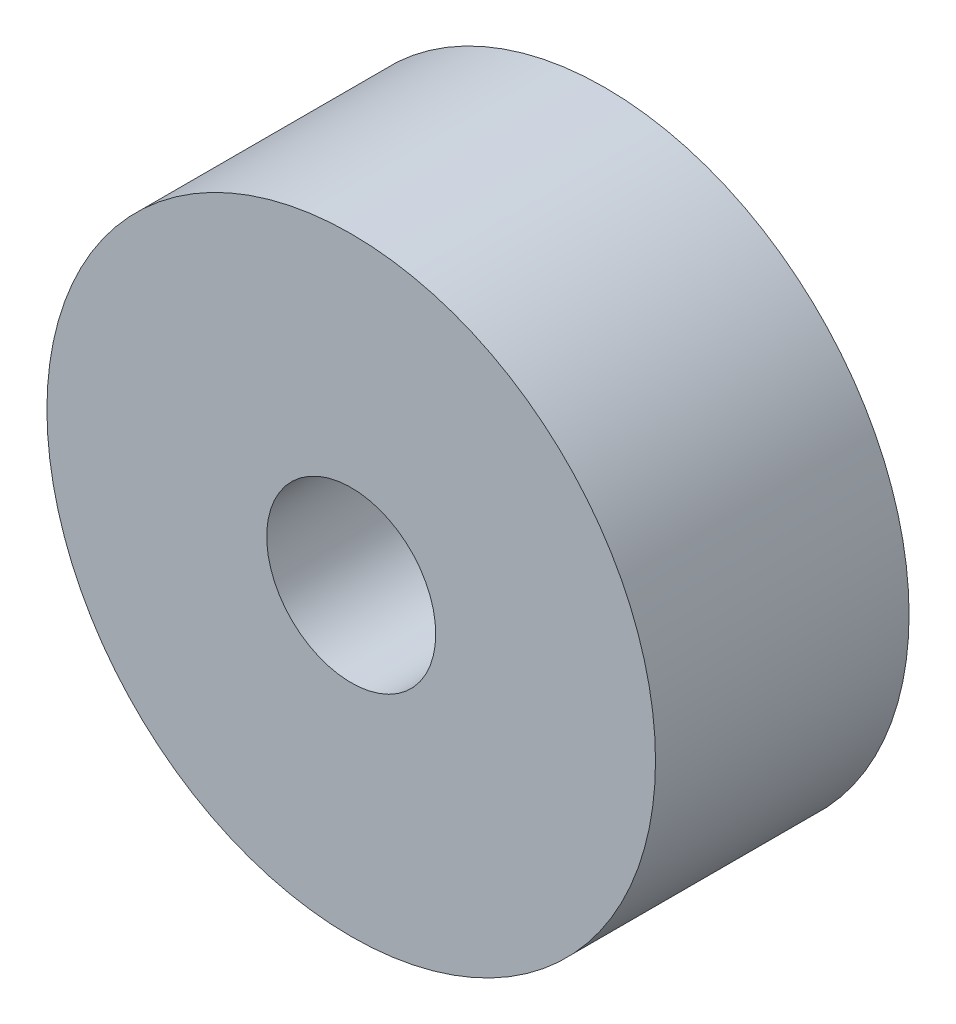
ISO-10303-21;
HEADER;
FILE_DESCRIPTION(('STEP AP214'),'2;1');
FILE_NAME('part.step','',(''),(''),'','','');
FILE_SCHEMA(('AUTOMOTIVE_DESIGN { 1 0 10303 214 1 1 1 1 }'));
ENDSEC;
DATA;
#1=APPLICATION_CONTEXT('core data for automotive mechanical design processes');
#2=APPLICATION_PROTOCOL_DEFINITION('international standard','automotive_design',2000,#1);
#3=PRODUCT_CONTEXT('',#1,'mechanical');
#4=PRODUCT('Part','Part','',(#3));
#5=PRODUCT_RELATED_PRODUCT_CATEGORY('part','',(#4));
#6=PRODUCT_DEFINITION_FORMATION('','',#4);
#7=PRODUCT_DEFINITION_CONTEXT('part definition',#1,'design');
#8=PRODUCT_DEFINITION('design','',#6,#7);
#9=PRODUCT_DEFINITION_SHAPE('','',#8);
#10=(LENGTH_UNIT() NAMED_UNIT(*) SI_UNIT(.MILLI.,.METRE.));
#11=(NAMED_UNIT(*) PLANE_ANGLE_UNIT() SI_UNIT($,.RADIAN.));
#12=(NAMED_UNIT(*) SI_UNIT($,.STERADIAN.) SOLID_ANGLE_UNIT());
#13=UNCERTAINTY_MEASURE_WITH_UNIT(LENGTH_MEASURE(1.E-05),#10,'distance_accuracy_value','');
#14=(GEOMETRIC_REPRESENTATION_CONTEXT(3) GLOBAL_UNCERTAINTY_ASSIGNED_CONTEXT((#13)) GLOBAL_UNIT_ASSIGNED_CONTEXT((#10,
#11,#12)) REPRESENTATION_CONTEXT('',''));
#15=CARTESIAN_POINT('',(0.,0.,0.));
#16=DIRECTION('',(0.,0.,1.));
#17=DIRECTION('',(1.,0.,0.));
#18=AXIS2_PLACEMENT_3D('',#15,#16,#17);
#19=CARTESIAN_POINT('',(0.,0.,3.));
#20=DIRECTION('',(0.,0.,1.));
#21=DIRECTION('',(1.,0.,0.));
#22=AXIS2_PLACEMENT_3D('',#19,#20,#21);
#23=PLANE('',#22);
#24=CARTESIAN_POINT('',(0.,0.,3.));
#25=DIRECTION('',(0.,0.,1.));
#26=DIRECTION('',(1.,0.,0.));
#27=AXIS2_PLACEMENT_3D('',#24,#25,#26);
#28=CIRCLE('',#27,3.6);
#29=CARTESIAN_POINT('',(3.6,0.,3.));
#30=VERTEX_POINT('',#29);
#31=EDGE_CURVE('E10',#30,#30,#28,.T.);
#32=ORIENTED_EDGE('',*,*,#31,.T.);
#33=EDGE_LOOP('',(#32));
#34=FACE_BOUND('',#33,.T.);
#35=CARTESIAN_POINT('',(0.,0.,3.));
#36=DIRECTION('',(0.,0.,1.));
#37=DIRECTION('',(1.,0.,0.));
#38=AXIS2_PLACEMENT_3D('',#35,#36,#37);
#39=CIRCLE('',#38,1.);
#40=CARTESIAN_POINT('',(1.,0.,3.));
#41=VERTEX_POINT('',#40);
#42=EDGE_CURVE('E54',#41,#41,#39,.T.);
#43=ORIENTED_EDGE('',*,*,#42,.F.);
#44=EDGE_LOOP('',(#43));
#45=FACE_BOUND('',#44,.T.);
#46=ADVANCED_FACE('F41',(#34,#45),#23,.T.);
#47=CARTESIAN_POINT('',(0.,0.,0.));
#48=DIRECTION('',(0.,0.,1.));
#49=DIRECTION('',(1.,0.,0.));
#50=AXIS2_PLACEMENT_3D('',#47,#48,#49);
#51=PLANE('',#50);
#52=CARTESIAN_POINT('',(0.,0.,0.));
#53=DIRECTION('',(0.,0.,1.));
#54=DIRECTION('',(1.,0.,0.));
#55=AXIS2_PLACEMENT_3D('',#52,#53,#54);
#56=CIRCLE('',#55,3.6);
#57=CARTESIAN_POINT('',(3.6,0.,0.));
#58=VERTEX_POINT('',#57);
#59=EDGE_CURVE('E45',#58,#58,#56,.T.);
#60=ORIENTED_EDGE('',*,*,#59,.F.);
#61=EDGE_LOOP('',(#60));
#62=FACE_BOUND('',#61,.T.);
#63=CARTESIAN_POINT('',(0.,0.,0.));
#64=DIRECTION('',(0.,0.,1.));
#65=DIRECTION('',(1.,0.,0.));
#66=AXIS2_PLACEMENT_3D('',#63,#64,#65);
#67=CIRCLE('',#66,1.);
#68=CARTESIAN_POINT('',(1.,0.,0.));
#69=VERTEX_POINT('',#68);
#70=EDGE_CURVE('E56',#69,#69,#67,.T.);
#71=ORIENTED_EDGE('',*,*,#70,.T.);
#72=EDGE_LOOP('',(#71));
#73=FACE_BOUND('',#72,.T.);
#74=ADVANCED_FACE('F68',(#62,#73),#51,.F.);
#75=CARTESIAN_POINT('',(0.,0.,3.));
#76=DIRECTION('',(0.,0.,-1.));
#77=DIRECTION('',(-1.,0.,0.));
#78=AXIS2_PLACEMENT_3D('',#75,#76,#77);
#79=CYLINDRICAL_SURFACE('',#78,3.6);
#80=ORIENTED_EDGE('',*,*,#31,.F.);
#81=EDGE_LOOP('',(#80));
#82=FACE_BOUND('',#81,.T.);
#83=ORIENTED_EDGE('',*,*,#59,.T.);
#84=EDGE_LOOP('',(#83));
#85=FACE_BOUND('',#84,.T.);
#86=ADVANCED_FACE('F43',(#82,#85),#79,.T.);
#87=CARTESIAN_POINT('',(0.,0.,3.));
#88=DIRECTION('',(0.,0.,-1.));
#89=DIRECTION('',(-1.,0.,0.));
#90=AXIS2_PLACEMENT_3D('',#87,#88,#89);
#91=CYLINDRICAL_SURFACE('',#90,1.);
#92=ORIENTED_EDGE('',*,*,#42,.T.);
#93=EDGE_LOOP('',(#92));
#94=FACE_BOUND('',#93,.T.);
#95=ORIENTED_EDGE('',*,*,#70,.F.);
#96=EDGE_LOOP('',(#95));
#97=FACE_BOUND('',#96,.T.);
#98=ADVANCED_FACE('F64',(#94,#97),#91,.F.);
#99=CLOSED_SHELL('',(#46,#74,#86,#98));
#100=MANIFOLD_SOLID_BREP('B2',#99);
#101=ADVANCED_BREP_SHAPE_REPRESENTATION('',(#18,#100),#14);
#102=SHAPE_DEFINITION_REPRESENTATION(#9,#101);
ENDSEC;
END-ISO-10303-21;
